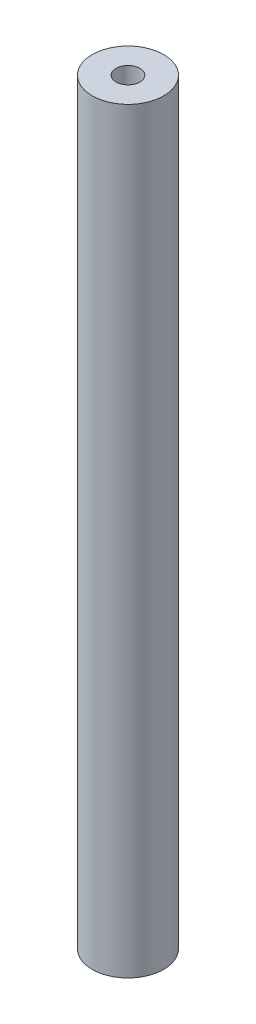
ISO-10303-21;
HEADER;
FILE_DESCRIPTION(('STEP AP214'),'2;1');
FILE_NAME('part.step','',(''),(''),'','','');
FILE_SCHEMA(('AUTOMOTIVE_DESIGN { 1 0 10303 214 1 1 1 1 }'));
ENDSEC;
DATA;
#1=APPLICATION_CONTEXT('core data for automotive mechanical design processes');
#2=APPLICATION_PROTOCOL_DEFINITION('international standard','automotive_design',2000,#1);
#3=PRODUCT_CONTEXT('',#1,'mechanical');
#4=PRODUCT('Part','Part','',(#3));
#5=PRODUCT_RELATED_PRODUCT_CATEGORY('part','',(#4));
#6=PRODUCT_DEFINITION_FORMATION('','',#4);
#7=PRODUCT_DEFINITION_CONTEXT('part definition',#1,'design');
#8=PRODUCT_DEFINITION('design','',#6,#7);
#9=PRODUCT_DEFINITION_SHAPE('','',#8);
#10=(LENGTH_UNIT() NAMED_UNIT(*) SI_UNIT(.MILLI.,.METRE.));
#11=(NAMED_UNIT(*) PLANE_ANGLE_UNIT() SI_UNIT($,.RADIAN.));
#12=(NAMED_UNIT(*) SI_UNIT($,.STERADIAN.) SOLID_ANGLE_UNIT());
#13=UNCERTAINTY_MEASURE_WITH_UNIT(LENGTH_MEASURE(1.E-05),#10,'distance_accuracy_value','');
#14=(GEOMETRIC_REPRESENTATION_CONTEXT(3) GLOBAL_UNCERTAINTY_ASSIGNED_CONTEXT((#13)) GLOBAL_UNIT_ASSIGNED_CONTEXT((#10,
#11,#12)) REPRESENTATION_CONTEXT('',''));
#15=CARTESIAN_POINT('',(0.,0.,0.));
#16=DIRECTION('',(0.,0.,1.));
#17=DIRECTION('',(1.,0.,0.));
#18=AXIS2_PLACEMENT_3D('',#15,#16,#17);
#19=CARTESIAN_POINT('',(0.,63.5,0.));
#20=DIRECTION('',(0.,1.,0.));
#21=DIRECTION('',(0.,0.,1.));
#22=AXIS2_PLACEMENT_3D('',#19,#20,#21);
#23=PLANE('',#22);
#24=CARTESIAN_POINT('',(0.,63.5,0.));
#25=DIRECTION('',(0.,1.,0.));
#26=DIRECTION('',(0.,0.,1.));
#27=AXIS2_PLACEMENT_3D('',#24,#25,#26);
#28=CIRCLE('',#27,3.);
#29=CARTESIAN_POINT('',(0.,63.5,3.));
#30=VERTEX_POINT('',#29);
#31=EDGE_CURVE('E10',#30,#30,#28,.T.);
#32=ORIENTED_EDGE('',*,*,#31,.T.);
#33=EDGE_LOOP('',(#32));
#34=FACE_BOUND('',#33,.T.);
#35=CARTESIAN_POINT('',(0.,63.5,0.));
#36=DIRECTION('',(0.,1.,0.));
#37=DIRECTION('',(0.,0.,1.));
#38=AXIS2_PLACEMENT_3D('',#35,#36,#37);
#39=CIRCLE('',#38,1.);
#40=CARTESIAN_POINT('',(0.,63.5,1.));
#41=VERTEX_POINT('',#40);
#42=EDGE_CURVE('E50',#41,#41,#39,.T.);
#43=ORIENTED_EDGE('',*,*,#42,.F.);
#44=EDGE_LOOP('',(#43));
#45=FACE_BOUND('',#44,.T.);
#46=ADVANCED_FACE('F37',(#34,#45),#23,.T.);
#47=CARTESIAN_POINT('',(0.,0.,0.));
#48=DIRECTION('',(0.,1.,0.));
#49=DIRECTION('',(0.,0.,1.));
#50=AXIS2_PLACEMENT_3D('',#47,#48,#49);
#51=PLANE('',#50);
#52=CARTESIAN_POINT('',(0.,0.,0.));
#53=DIRECTION('',(0.,1.,0.));
#54=DIRECTION('',(0.,0.,1.));
#55=AXIS2_PLACEMENT_3D('',#52,#53,#54);
#56=CIRCLE('',#55,3.);
#57=CARTESIAN_POINT('',(0.,0.,3.));
#58=VERTEX_POINT('',#57);
#59=EDGE_CURVE('E41',#58,#58,#56,.T.);
#60=ORIENTED_EDGE('',*,*,#59,.F.);
#61=EDGE_LOOP('',(#60));
#62=FACE_BOUND('',#61,.T.);
#63=CARTESIAN_POINT('',(0.,0.,0.));
#64=DIRECTION('',(0.,1.,0.));
#65=DIRECTION('',(0.,0.,1.));
#66=AXIS2_PLACEMENT_3D('',#63,#64,#65);
#67=CIRCLE('',#66,1.);
#68=CARTESIAN_POINT('',(0.,0.,1.));
#69=VERTEX_POINT('',#68);
#70=EDGE_CURVE('E52',#69,#69,#67,.T.);
#71=ORIENTED_EDGE('',*,*,#70,.T.);
#72=EDGE_LOOP('',(#71));
#73=FACE_BOUND('',#72,.T.);
#74=ADVANCED_FACE('F64',(#62,#73),#51,.F.);
#75=CARTESIAN_POINT('',(0.,63.5,0.));
#76=DIRECTION('',(0.,-1.,0.));
#77=DIRECTION('',(0.,0.,-1.));
#78=AXIS2_PLACEMENT_3D('',#75,#76,#77);
#79=CYLINDRICAL_SURFACE('',#78,3.);
#80=ORIENTED_EDGE('',*,*,#31,.F.);
#81=EDGE_LOOP('',(#80));
#82=FACE_BOUND('',#81,.T.);
#83=ORIENTED_EDGE('',*,*,#59,.T.);
#84=EDGE_LOOP('',(#83));
#85=FACE_BOUND('',#84,.T.);
#86=ADVANCED_FACE('F39',(#82,#85),#79,.T.);
#87=CARTESIAN_POINT('',(0.,63.5,0.));
#88=DIRECTION('',(0.,-1.,0.));
#89=DIRECTION('',(0.,0.,-1.));
#90=AXIS2_PLACEMENT_3D('',#87,#88,#89);
#91=CYLINDRICAL_SURFACE('',#90,1.);
#92=ORIENTED_EDGE('',*,*,#42,.T.);
#93=EDGE_LOOP('',(#92));
#94=FACE_BOUND('',#93,.T.);
#95=ORIENTED_EDGE('',*,*,#70,.F.);
#96=EDGE_LOOP('',(#95));
#97=FACE_BOUND('',#96,.T.);
#98=ADVANCED_FACE('F60',(#94,#97),#91,.F.);
#99=CLOSED_SHELL('',(#46,#74,#86,#98));
#100=MANIFOLD_SOLID_BREP('B2',#99);
#101=ADVANCED_BREP_SHAPE_REPRESENTATION('',(#18,#100),#14);
#102=SHAPE_DEFINITION_REPRESENTATION(#9,#101);
ENDSEC;
END-ISO-10303-21;
